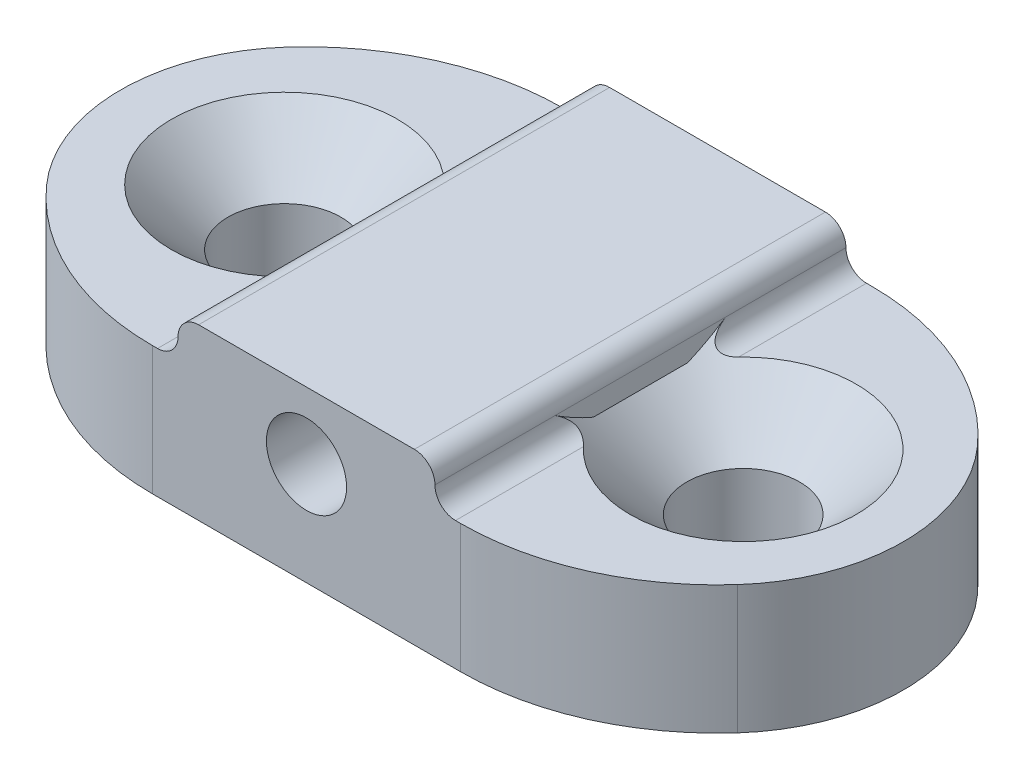
ISO-10303-21;
HEADER;
FILE_DESCRIPTION(('STEP AP214'),'2;1');
FILE_NAME('part.step','',(''),(''),'','','');
FILE_SCHEMA(('AUTOMOTIVE_DESIGN { 1 0 10303 214 1 1 1 1 }'));
ENDSEC;
DATA;
#1=APPLICATION_CONTEXT('core data for automotive mechanical design processes');
#2=APPLICATION_PROTOCOL_DEFINITION('international standard','automotive_design',2000,#1);
#3=PRODUCT_CONTEXT('',#1,'mechanical');
#4=PRODUCT('Part','Part','',(#3));
#5=PRODUCT_RELATED_PRODUCT_CATEGORY('part','',(#4));
#6=PRODUCT_DEFINITION_FORMATION('','',#4);
#7=PRODUCT_DEFINITION_CONTEXT('part definition',#1,'design');
#8=PRODUCT_DEFINITION('design','',#6,#7);
#9=PRODUCT_DEFINITION_SHAPE('','',#8);
#10=(LENGTH_UNIT() NAMED_UNIT(*) SI_UNIT(.MILLI.,.METRE.));
#11=(NAMED_UNIT(*) PLANE_ANGLE_UNIT() SI_UNIT($,.RADIAN.));
#12=(NAMED_UNIT(*) SI_UNIT($,.STERADIAN.) SOLID_ANGLE_UNIT());
#13=UNCERTAINTY_MEASURE_WITH_UNIT(LENGTH_MEASURE(1.E-05),#10,'distance_accuracy_value','');
#14=(GEOMETRIC_REPRESENTATION_CONTEXT(3) GLOBAL_UNCERTAINTY_ASSIGNED_CONTEXT((#13)) GLOBAL_UNIT_ASSIGNED_CONTEXT((#10,
#11,#12)) REPRESENTATION_CONTEXT('',''));
#15=CARTESIAN_POINT('',(0.,0.,0.));
#16=DIRECTION('',(0.,0.,1.));
#17=DIRECTION('',(1.,0.,0.));
#18=AXIS2_PLACEMENT_3D('',#15,#16,#17);
#19=CARTESIAN_POINT('',(0.,2.5,0.));
#20=DIRECTION('',(0.,-1.,0.));
#21=DIRECTION('',(0.,0.,-1.));
#22=AXIS2_PLACEMENT_3D('',#19,#20,#21);
#23=PLANE('',#22);
#24=CARTESIAN_POINT('',(5.,2.5,-3.));
#25=DIRECTION('',(0.,-1.,0.));
#26=DIRECTION('',(0.,0.,-1.));
#27=AXIS2_PLACEMENT_3D('',#24,#25,#26);
#28=CIRCLE('',#27,5.);
#29=CARTESIAN_POINT('',(5.,2.5,-8.));
#30=VERTEX_POINT('',#29);
#31=CARTESIAN_POINT('',(1.27322003750035,2.5,-6.33333333333333));
#32=VERTEX_POINT('',#31);
#33=EDGE_CURVE('E363',#30,#32,#28,.F.);
#34=ORIENTED_EDGE('',*,*,#33,.T.);
#35=CARTESIAN_POINT('',(3.88196601125011,2.5,-4.));
#36=DIRECTION('',(0.,-1.,0.));
#37=DIRECTION('',(0.,0.,-1.));
#38=AXIS2_PLACEMENT_3D('',#35,#36,#37);
#39=CIRCLE('',#38,3.5);
#40=CARTESIAN_POINT('',(1.27322003750035,2.5,-1.66666666666667));
#41=VERTEX_POINT('',#40);
#42=EDGE_CURVE('E368',#32,#41,#39,.F.);
#43=ORIENTED_EDGE('',*,*,#42,.T.);
#44=CARTESIAN_POINT('',(5.,2.5,-5.));
#45=DIRECTION('',(0.,-1.,0.));
#46=DIRECTION('',(0.,0.,-1.));
#47=AXIS2_PLACEMENT_3D('',#44,#45,#46);
#48=CIRCLE('',#47,5.);
#49=CARTESIAN_POINT('',(5.,2.5,0.));
#50=VERTEX_POINT('',#49);
#51=EDGE_CURVE('E361',#41,#50,#48,.F.);
#52=ORIENTED_EDGE('',*,*,#51,.T.);
#53=DIRECTION('',(1.,0.,0.));
#54=VECTOR('',#53,1.);
#55=CARTESIAN_POINT('',(0.,2.5,0.));
#56=LINE('',#55,#54);
#57=CARTESIAN_POINT('',(5.1,2.5,0.));
#58=VERTEX_POINT('',#57);
#59=EDGE_CURVE('E200',#50,#58,#56,.T.);
#60=ORIENTED_EDGE('',*,*,#59,.T.);
#61=DIRECTION('',(0.,0.,1.));
#62=VECTOR('',#61,1.);
#63=CARTESIAN_POINT('',(5.1,2.5,0.));
#64=LINE('',#63,#62);
#65=CARTESIAN_POINT('',(5.1,2.5,-2.41808901716345));
#66=VERTEX_POINT('',#65);
#67=EDGE_CURVE('E251',#58,#66,#64,.F.);
#68=ORIENTED_EDGE('',*,*,#67,.T.);
#69=CARTESIAN_POINT('',(3.57109266389977,2.5,-4.));
#70=DIRECTION('',(0.,1.,0.));
#71=DIRECTION('',(0.,0.,1.));
#72=AXIS2_PLACEMENT_3D('',#69,#70,#71);
#73=CIRCLE('',#72,2.2);
#74=CARTESIAN_POINT('',(5.1,2.5,-5.58191098283655));
#75=VERTEX_POINT('',#74);
#76=EDGE_CURVE('E415',#75,#66,#73,.T.);
#77=ORIENTED_EDGE('',*,*,#76,.F.);
#78=DIRECTION('',(0.,0.,1.));
#79=VECTOR('',#78,1.);
#80=CARTESIAN_POINT('',(5.1,2.5,0.));
#81=LINE('',#80,#79);
#82=CARTESIAN_POINT('',(5.1,2.5,-8.));
#83=VERTEX_POINT('',#82);
#84=EDGE_CURVE('E481',#75,#83,#81,.F.);
#85=ORIENTED_EDGE('',*,*,#84,.T.);
#86=DIRECTION('',(-1.,0.,0.));
#87=VECTOR('',#86,1.);
#88=CARTESIAN_POINT('',(0.,2.5,-8.));
#89=LINE('',#88,#87);
#90=EDGE_CURVE('E202',#83,#30,#89,.T.);
#91=ORIENTED_EDGE('',*,*,#90,.T.);
#92=EDGE_LOOP('',(#34,#43,#52,#60,#68,#77,#85,#91));
#93=FACE_BOUND('',#92,.T.);
#94=ADVANCED_FACE('F34',(#93),#23,.F.);
#95=CARTESIAN_POINT('',(0.,2.5,0.));
#96=DIRECTION('',(0.,0.,-1.));
#97=DIRECTION('',(-1.,0.,0.));
#98=AXIS2_PLACEMENT_3D('',#95,#96,#97);
#99=PLANE('',#98);
#100=CARTESIAN_POINT('',(8.,2.,0.));
#101=DIRECTION('',(0.,0.,-1.));
#102=DIRECTION('',(-1.,0.,0.));
#103=AXIS2_PLACEMENT_3D('',#100,#101,#102);
#104=CIRCLE('',#103,0.779999999999999);
#105=CARTESIAN_POINT('',(7.22,2.,0.));
#106=VERTEX_POINT('',#105);
#107=EDGE_CURVE('E444',#106,#106,#104,.T.);
#108=ORIENTED_EDGE('',*,*,#107,.T.);
#109=EDGE_LOOP('',(#108));
#110=FACE_BOUND('',#109,.T.);
#111=DIRECTION('',(1.,0.,0.));
#112=VECTOR('',#111,1.);
#113=CARTESIAN_POINT('',(0.,0.,0.));
#114=LINE('',#113,#112);
#115=CARTESIAN_POINT('',(5.,0.,0.));
#116=VERTEX_POINT('',#115);
#117=CARTESIAN_POINT('',(11.,0.,0.));
#118=VERTEX_POINT('',#117);
#119=EDGE_CURVE('E193',#116,#118,#114,.T.);
#120=ORIENTED_EDGE('',*,*,#119,.T.);
#121=DIRECTION('',(0.,-1.,0.));
#122=VECTOR('',#121,1.);
#123=CARTESIAN_POINT('',(11.,2.5,0.));
#124=LINE('',#123,#122);
#125=CARTESIAN_POINT('',(11.,2.5,0.));
#126=VERTEX_POINT('',#125);
#127=EDGE_CURVE('E356',#118,#126,#124,.F.);
#128=ORIENTED_EDGE('',*,*,#127,.T.);
#129=CARTESIAN_POINT('',(10.9,2.5,0.));
#130=VERTEX_POINT('',#129);
#131=EDGE_CURVE('E203',#130,#126,#56,.T.);
#132=ORIENTED_EDGE('',*,*,#131,.F.);
#133=CARTESIAN_POINT('',(10.9,2.9,0.));
#134=DIRECTION('',(0.,0.,-1.));
#135=DIRECTION('',(-1.,0.,0.));
#136=AXIS2_PLACEMENT_3D('',#133,#134,#135);
#137=CIRCLE('',#136,0.4);
#138=CARTESIAN_POINT('',(10.5,2.9,0.));
#139=VERTEX_POINT('',#138);
#140=EDGE_CURVE('E281',#130,#139,#137,.T.);
#141=ORIENTED_EDGE('',*,*,#140,.T.);
#142=CARTESIAN_POINT('',(10.1,2.9,0.));
#143=DIRECTION('',(0.,0.,-1.));
#144=DIRECTION('',(-1.,0.,0.));
#145=AXIS2_PLACEMENT_3D('',#142,#143,#144);
#146=CIRCLE('',#145,0.4);
#147=CARTESIAN_POINT('',(10.1,3.3,0.));
#148=VERTEX_POINT('',#147);
#149=EDGE_CURVE('E426',#139,#148,#146,.F.);
#150=ORIENTED_EDGE('',*,*,#149,.T.);
#151=DIRECTION('',(-1.,0.,0.));
#152=VECTOR('',#151,1.);
#153=CARTESIAN_POINT('',(5.5,3.3,0.));
#154=LINE('',#153,#152);
#155=CARTESIAN_POINT('',(5.9,3.3,0.));
#156=VERTEX_POINT('',#155);
#157=EDGE_CURVE('E196',#148,#156,#154,.T.);
#158=ORIENTED_EDGE('',*,*,#157,.T.);
#159=CARTESIAN_POINT('',(5.9,2.9,0.));
#160=DIRECTION('',(0.,0.,-1.));
#161=DIRECTION('',(-1.,0.,0.));
#162=AXIS2_PLACEMENT_3D('',#159,#160,#161);
#163=CIRCLE('',#162,0.4);
#164=CARTESIAN_POINT('',(5.5,2.9,0.));
#165=VERTEX_POINT('',#164);
#166=EDGE_CURVE('E449',#156,#165,#163,.F.);
#167=ORIENTED_EDGE('',*,*,#166,.T.);
#168=CARTESIAN_POINT('',(5.1,2.9,0.));
#169=DIRECTION('',(0.,0.,-1.));
#170=DIRECTION('',(-1.,0.,0.));
#171=AXIS2_PLACEMENT_3D('',#168,#169,#170);
#172=CIRCLE('',#171,0.4);
#173=EDGE_CURVE('E280',#165,#58,#172,.T.);
#174=ORIENTED_EDGE('',*,*,#173,.T.);
#175=ORIENTED_EDGE('',*,*,#59,.F.);
#176=DIRECTION('',(0.,-1.,0.));
#177=VECTOR('',#176,1.);
#178=CARTESIAN_POINT('',(5.,2.5,0.));
#179=LINE('',#178,#177);
#180=EDGE_CURVE('E390',#50,#116,#179,.T.);
#181=ORIENTED_EDGE('',*,*,#180,.T.);
#182=EDGE_LOOP('',(#120,#128,#132,#141,#150,#158,#167,#174,#175,#181));
#183=FACE_BOUND('',#182,.T.);
#184=ADVANCED_FACE('F262',(#110,#183),#99,.F.);
#185=CARTESIAN_POINT('',(0.,2.5,-8.));
#186=DIRECTION('',(0.,0.,1.));
#187=DIRECTION('',(1.,0.,0.));
#188=AXIS2_PLACEMENT_3D('',#185,#186,#187);
#189=PLANE('',#188);
#190=CARTESIAN_POINT('',(8.,2.,-8.));
#191=DIRECTION('',(0.,0.,1.));
#192=DIRECTION('',(1.,0.,0.));
#193=AXIS2_PLACEMENT_3D('',#190,#191,#192);
#194=CIRCLE('',#193,0.779999999999999);
#195=CARTESIAN_POINT('',(8.78,2.,-8.));
#196=VERTEX_POINT('',#195);
#197=EDGE_CURVE('E441',#196,#196,#194,.T.);
#198=ORIENTED_EDGE('',*,*,#197,.T.);
#199=EDGE_LOOP('',(#198));
#200=FACE_BOUND('',#199,.T.);
#201=CARTESIAN_POINT('',(11.,2.5,-8.));
#202=VERTEX_POINT('',#201);
#203=CARTESIAN_POINT('',(10.9,2.5,-8.));
#204=VERTEX_POINT('',#203);
#205=EDGE_CURVE('E204',#202,#204,#89,.T.);
#206=ORIENTED_EDGE('',*,*,#205,.F.);
#207=DIRECTION('',(0.,-1.,0.));
#208=VECTOR('',#207,1.);
#209=CARTESIAN_POINT('',(11.,2.5,-8.));
#210=LINE('',#209,#208);
#211=CARTESIAN_POINT('',(11.,0.,-8.));
#212=VERTEX_POINT('',#211);
#213=EDGE_CURVE('E354',#202,#212,#210,.T.);
#214=ORIENTED_EDGE('',*,*,#213,.T.);
#215=DIRECTION('',(-1.,0.,0.));
#216=VECTOR('',#215,1.);
#217=CARTESIAN_POINT('',(0.,0.,-8.));
#218=LINE('',#217,#216);
#219=CARTESIAN_POINT('',(5.,0.,-8.));
#220=VERTEX_POINT('',#219);
#221=EDGE_CURVE('E209',#212,#220,#218,.T.);
#222=ORIENTED_EDGE('',*,*,#221,.T.);
#223=DIRECTION('',(0.,-1.,0.));
#224=VECTOR('',#223,1.);
#225=CARTESIAN_POINT('',(5.,2.5,-8.));
#226=LINE('',#225,#224);
#227=EDGE_CURVE('E350',#220,#30,#226,.F.);
#228=ORIENTED_EDGE('',*,*,#227,.T.);
#229=ORIENTED_EDGE('',*,*,#90,.F.);
#230=CARTESIAN_POINT('',(5.1,2.9,-8.));
#231=DIRECTION('',(0.,0.,1.));
#232=DIRECTION('',(1.,0.,0.));
#233=AXIS2_PLACEMENT_3D('',#230,#231,#232);
#234=CIRCLE('',#233,0.4);
#235=CARTESIAN_POINT('',(5.5,2.9,-8.));
#236=VERTEX_POINT('',#235);
#237=EDGE_CURVE('E403',#83,#236,#234,.T.);
#238=ORIENTED_EDGE('',*,*,#237,.T.);
#239=CARTESIAN_POINT('',(5.9,2.9,-8.));
#240=DIRECTION('',(0.,0.,1.));
#241=DIRECTION('',(1.,0.,0.));
#242=AXIS2_PLACEMENT_3D('',#239,#240,#241);
#243=CIRCLE('',#242,0.4);
#244=CARTESIAN_POINT('',(5.9,3.3,-8.));
#245=VERTEX_POINT('',#244);
#246=EDGE_CURVE('E458',#236,#245,#243,.F.);
#247=ORIENTED_EDGE('',*,*,#246,.T.);
#248=DIRECTION('',(1.,0.,0.));
#249=VECTOR('',#248,1.);
#250=CARTESIAN_POINT('',(5.5,3.3,-8.));
#251=LINE('',#250,#249);
#252=CARTESIAN_POINT('',(10.1,3.3,-8.));
#253=VERTEX_POINT('',#252);
#254=EDGE_CURVE('E189',#245,#253,#251,.T.);
#255=ORIENTED_EDGE('',*,*,#254,.T.);
#256=CARTESIAN_POINT('',(10.1,2.9,-8.));
#257=DIRECTION('',(0.,0.,1.));
#258=DIRECTION('',(1.,0.,0.));
#259=AXIS2_PLACEMENT_3D('',#256,#257,#258);
#260=CIRCLE('',#259,0.4);
#261=CARTESIAN_POINT('',(10.5,2.9,-8.));
#262=VERTEX_POINT('',#261);
#263=EDGE_CURVE('E423',#253,#262,#260,.F.);
#264=ORIENTED_EDGE('',*,*,#263,.T.);
#265=CARTESIAN_POINT('',(10.9,2.9,-8.));
#266=DIRECTION('',(0.,0.,1.));
#267=DIRECTION('',(1.,0.,0.));
#268=AXIS2_PLACEMENT_3D('',#265,#266,#267);
#269=CIRCLE('',#268,0.4);
#270=EDGE_CURVE('E250',#262,#204,#269,.T.);
#271=ORIENTED_EDGE('',*,*,#270,.T.);
#272=EDGE_LOOP('',(#206,#214,#222,#228,#229,#238,#247,#255,#264,#271));
#273=FACE_BOUND('',#272,.T.);
#274=ADVANCED_FACE('F332',(#200,#273),#189,.F.);
#275=CARTESIAN_POINT('',(11.,2.5,-5.));
#276=DIRECTION('',(0.,-1.,0.));
#277=DIRECTION('',(0.,0.,-1.));
#278=AXIS2_PLACEMENT_3D('',#275,#276,#277);
#279=CIRCLE('',#278,5.);
#280=CARTESIAN_POINT('',(14.7267799624996,2.5,-1.66666666666667));
#281=VERTEX_POINT('',#280);
#282=EDGE_CURVE('E346',#126,#281,#279,.F.);
#283=ORIENTED_EDGE('',*,*,#282,.T.);
#284=CARTESIAN_POINT('',(12.1180339887499,2.5,-4.));
#285=DIRECTION('',(0.,-1.,0.));
#286=DIRECTION('',(0.,0.,-1.));
#287=AXIS2_PLACEMENT_3D('',#284,#285,#286);
#288=CIRCLE('',#287,3.5);
#289=CARTESIAN_POINT('',(14.7267799624996,2.5,-6.33333333333333));
#290=VERTEX_POINT('',#289);
#291=EDGE_CURVE('E42',#281,#290,#288,.F.);
#292=ORIENTED_EDGE('',*,*,#291,.T.);
#293=CARTESIAN_POINT('',(11.,2.5,-3.));
#294=DIRECTION('',(0.,-1.,0.));
#295=DIRECTION('',(0.,0.,-1.));
#296=AXIS2_PLACEMENT_3D('',#293,#294,#295);
#297=CIRCLE('',#296,5.);
#298=EDGE_CURVE('E351',#290,#202,#297,.F.);
#299=ORIENTED_EDGE('',*,*,#298,.T.);
#300=ORIENTED_EDGE('',*,*,#205,.T.);
#301=DIRECTION('',(0.,0.,1.));
#302=VECTOR('',#301,1.);
#303=CARTESIAN_POINT('',(10.9,2.5,0.));
#304=LINE('',#303,#302);
#305=CARTESIAN_POINT('',(10.9,2.5,-5.50996688705415));
#306=VERTEX_POINT('',#305);
#307=EDGE_CURVE('E213',#204,#306,#304,.T.);
#308=ORIENTED_EDGE('',*,*,#307,.T.);
#309=CARTESIAN_POINT('',(12.5,2.5,-4.));
#310=DIRECTION('',(0.,1.,0.));
#311=DIRECTION('',(0.,0.,1.));
#312=AXIS2_PLACEMENT_3D('',#309,#310,#311);
#313=CIRCLE('',#312,2.2);
#314=CARTESIAN_POINT('',(10.9,2.5,-2.49003311294585));
#315=VERTEX_POINT('',#314);
#316=EDGE_CURVE('E186',#315,#306,#313,.T.);
#317=ORIENTED_EDGE('',*,*,#316,.F.);
#318=DIRECTION('',(0.,0.,1.));
#319=VECTOR('',#318,1.);
#320=CARTESIAN_POINT('',(10.9,2.5,0.));
#321=LINE('',#320,#319);
#322=EDGE_CURVE('E206',#315,#130,#321,.T.);
#323=ORIENTED_EDGE('',*,*,#322,.T.);
#324=ORIENTED_EDGE('',*,*,#131,.T.);
#325=EDGE_LOOP('',(#283,#292,#299,#300,#308,#317,#323,#324));
#326=FACE_BOUND('',#325,.T.);
#327=ADVANCED_FACE('F328',(#326),#23,.F.);
#328=CARTESIAN_POINT('',(0.,0.,0.));
#329=DIRECTION('',(0.,-1.,0.));
#330=DIRECTION('',(0.,0.,-1.));
#331=AXIS2_PLACEMENT_3D('',#328,#329,#330);
#332=PLANE('',#331);
#333=CARTESIAN_POINT('',(3.57109266389977,0.,-4.));
#334=DIRECTION('',(0.,1.,0.));
#335=DIRECTION('',(0.,0.,1.));
#336=AXIS2_PLACEMENT_3D('',#333,#334,#335);
#337=CIRCLE('',#336,1.1);
#338=CARTESIAN_POINT('',(3.57109266389977,0.,-2.9));
#339=VERTEX_POINT('',#338);
#340=EDGE_CURVE('E430',#339,#339,#337,.T.);
#341=ORIENTED_EDGE('',*,*,#340,.T.);
#342=EDGE_LOOP('',(#341));
#343=FACE_BOUND('',#342,.T.);
#344=CARTESIAN_POINT('',(12.5,0.,-4.));
#345=DIRECTION('',(0.,1.,0.));
#346=DIRECTION('',(0.,0.,1.));
#347=AXIS2_PLACEMENT_3D('',#344,#345,#346);
#348=CIRCLE('',#347,1.1);
#349=CARTESIAN_POINT('',(12.5,0.,-2.9));
#350=VERTEX_POINT('',#349);
#351=EDGE_CURVE('E438',#350,#350,#348,.T.);
#352=ORIENTED_EDGE('',*,*,#351,.T.);
#353=EDGE_LOOP('',(#352));
#354=FACE_BOUND('',#353,.T.);
#355=CARTESIAN_POINT('',(5.,0.,-5.));
#356=DIRECTION('',(0.,-1.,0.));
#357=DIRECTION('',(0.,0.,-1.));
#358=AXIS2_PLACEMENT_3D('',#355,#356,#357);
#359=CIRCLE('',#358,5.);
#360=CARTESIAN_POINT('',(1.27322003750035,0.,-1.66666666666667));
#361=VERTEX_POINT('',#360);
#362=EDGE_CURVE('E392',#116,#361,#359,.T.);
#363=ORIENTED_EDGE('',*,*,#362,.T.);
#364=CARTESIAN_POINT('',(3.88196601125011,0.,-4.));
#365=DIRECTION('',(0.,-1.,0.));
#366=DIRECTION('',(0.,0.,-1.));
#367=AXIS2_PLACEMENT_3D('',#364,#365,#366);
#368=CIRCLE('',#367,3.5);
#369=CARTESIAN_POINT('',(1.27322003750035,0.,-6.33333333333333));
#370=VERTEX_POINT('',#369);
#371=EDGE_CURVE('E374',#361,#370,#368,.T.);
#372=ORIENTED_EDGE('',*,*,#371,.T.);
#373=CARTESIAN_POINT('',(5.,0.,-3.));
#374=DIRECTION('',(0.,-1.,0.));
#375=DIRECTION('',(0.,0.,-1.));
#376=AXIS2_PLACEMENT_3D('',#373,#374,#375);
#377=CIRCLE('',#376,5.);
#378=EDGE_CURVE('E388',#370,#220,#377,.T.);
#379=ORIENTED_EDGE('',*,*,#378,.T.);
#380=ORIENTED_EDGE('',*,*,#221,.F.);
#381=CARTESIAN_POINT('',(11.,0.,-3.));
#382=DIRECTION('',(0.,-1.,0.));
#383=DIRECTION('',(0.,0.,-1.));
#384=AXIS2_PLACEMENT_3D('',#381,#382,#383);
#385=CIRCLE('',#384,5.);
#386=CARTESIAN_POINT('',(14.7267799624996,0.,-6.33333333333333));
#387=VERTEX_POINT('',#386);
#388=EDGE_CURVE('E386',#212,#387,#385,.T.);
#389=ORIENTED_EDGE('',*,*,#388,.T.);
#390=CARTESIAN_POINT('',(12.1180339887499,0.,-4.));
#391=DIRECTION('',(0.,-1.,0.));
#392=DIRECTION('',(0.,0.,-1.));
#393=AXIS2_PLACEMENT_3D('',#390,#391,#392);
#394=CIRCLE('',#393,3.5);
#395=CARTESIAN_POINT('',(14.7267799624996,0.,-1.66666666666667));
#396=VERTEX_POINT('',#395);
#397=EDGE_CURVE('E372',#387,#396,#394,.T.);
#398=ORIENTED_EDGE('',*,*,#397,.T.);
#399=CARTESIAN_POINT('',(11.,0.,-5.));
#400=DIRECTION('',(0.,-1.,0.));
#401=DIRECTION('',(0.,0.,-1.));
#402=AXIS2_PLACEMENT_3D('',#399,#400,#401);
#403=CIRCLE('',#402,5.);
#404=EDGE_CURVE('E378',#396,#118,#403,.T.);
#405=ORIENTED_EDGE('',*,*,#404,.T.);
#406=ORIENTED_EDGE('',*,*,#119,.F.);
#407=EDGE_LOOP('',(#363,#372,#379,#380,#389,#398,#405,#406));
#408=FACE_BOUND('',#407,.T.);
#409=ADVANCED_FACE('F337',(#343,#354,#408),#332,.T.);
#410=CARTESIAN_POINT('',(5.5,2.5,-13.0635955604689));
#411=DIRECTION('',(-1.,0.,0.));
#412=DIRECTION('',(0.,-1.,0.));
#413=AXIS2_PLACEMENT_3D('',#410,#411,#412);
#414=PLANE('',#413);
#415=DIRECTION('',(0.,0.,1.));
#416=VECTOR('',#415,1.);
#417=CARTESIAN_POINT('',(5.5,2.5,-13.0635955604689));
#418=LINE('',#417,#416);
#419=CARTESIAN_POINT('',(5.5,2.5,-5.05797754642463));
#420=VERTEX_POINT('',#419);
#421=CARTESIAN_POINT('',(5.5,2.5,-2.94202245357536));
#422=VERTEX_POINT('',#421);
#423=EDGE_CURVE('E190',#420,#422,#418,.T.);
#424=ORIENTED_EDGE('',*,*,#423,.T.);
#425=CARTESIAN_POINT('',(5.5,2.5,-2.94202245357536));
#426=CARTESIAN_POINT('',(5.5,2.52872917775644,-2.8823228496387));
#427=CARTESIAN_POINT('',(5.5,2.55893294478922,-2.82335937948788));
#428=CARTESIAN_POINT('',(5.5,2.62175738827018,-2.70682487240755));
#429=CARTESIAN_POINT('',(5.5,2.6543750152887,-2.64925219651247));
#430=CARTESIAN_POINT('',(5.5,2.72155791669848,-2.53529023365637));
#431=CARTESIAN_POINT('',(5.5,2.75612255971361,-2.47890057111754));
#432=CARTESIAN_POINT('',(5.5,2.82691084229986,-2.36707219379437));
#433=CARTESIAN_POINT('',(5.5,2.86313648702678,-2.31163474568505));
#434=CARTESIAN_POINT('',(5.5,2.90000000000016,-2.25663644389946));
#435=B_SPLINE_CURVE_WITH_KNOTS('',3,(#425,#426,#427,#428,#429,#430,#431,#432,#433,#434),
.UNSPECIFIED.,.F.,.F.,(4,2,2,2,4),(0.,0.198703135537779,0.397159399098888,0.595551673880541,
0.794190099681815),.UNSPECIFIED.);
#436=CARTESIAN_POINT('',(5.5,2.9,-2.25663644389938));
#437=VERTEX_POINT('',#436);
#438=EDGE_CURVE('E476',#422,#437,#435,.T.);
#439=ORIENTED_EDGE('',*,*,#438,.T.);
#440=DIRECTION('',(0.,0.,1.));
#441=VECTOR('',#440,1.);
#442=CARTESIAN_POINT('',(5.5,2.9,-13.0635955604689));
#443=LINE('',#442,#441);
#444=CARTESIAN_POINT('',(5.5,2.9,-5.74336355610062));
#445=VERTEX_POINT('',#444);
#446=EDGE_CURVE('E470',#437,#445,#443,.F.);
#447=ORIENTED_EDGE('',*,*,#446,.T.);
#448=CARTESIAN_POINT('',(5.5,2.9,-5.74336355610062));
#449=CARTESIAN_POINT('',(5.5,2.86313648702672,-5.68836525431496));
#450=CARTESIAN_POINT('',(5.5,2.82691084229984,-5.63292780620562));
#451=CARTESIAN_POINT('',(5.5,2.75612255971362,-5.52109942888244));
#452=CARTESIAN_POINT('',(5.5,2.72155791669848,-5.46470976634362));
#453=CARTESIAN_POINT('',(5.5,2.65437501528869,-5.35074780348753));
#454=CARTESIAN_POINT('',(5.5,2.62175738827018,-5.29317512759244));
#455=CARTESIAN_POINT('',(5.5,2.55893294478922,-5.17664062051212));
#456=CARTESIAN_POINT('',(5.5,2.52872917775644,-5.11767715036129));
#457=CARTESIAN_POINT('',(5.5,2.5,-5.05797754642463));
#458=B_SPLINE_CURVE_WITH_KNOTS('',3,(#448,#449,#450,#451,#452,#453,#454,#455,#456,#457),
.UNSPECIFIED.,.F.,.F.,(4,2,2,2,4),(0.,0.198638425801267,0.397030700582914,0.595486964144023,
0.794190099681799),.UNSPECIFIED.);
#459=EDGE_CURVE('E465',#445,#420,#458,.T.);
#460=ORIENTED_EDGE('',*,*,#459,.T.);
#461=EDGE_LOOP('',(#424,#439,#447,#460));
#462=FACE_BOUND('',#461,.T.);
#463=ADVANCED_FACE('F342',(#462),#414,.T.);
#464=CARTESIAN_POINT('',(5.5,3.3,-13.0635955604689));
#465=DIRECTION('',(0.,1.,0.));
#466=DIRECTION('',(-1.,0.,0.));
#467=AXIS2_PLACEMENT_3D('',#464,#465,#466);
#468=PLANE('',#467);
#469=ORIENTED_EDGE('',*,*,#157,.F.);
#470=DIRECTION('',(0.,0.,1.));
#471=VECTOR('',#470,1.);
#472=CARTESIAN_POINT('',(10.1,3.3,-13.0635955604689));
#473=LINE('',#472,#471);
#474=EDGE_CURVE('E455',#148,#253,#473,.F.);
#475=ORIENTED_EDGE('',*,*,#474,.T.);
#476=ORIENTED_EDGE('',*,*,#254,.F.);
#477=DIRECTION('',(0.,0.,1.));
#478=VECTOR('',#477,1.);
#479=CARTESIAN_POINT('',(5.9,3.3,-13.0635955604689));
#480=LINE('',#479,#478);
#481=EDGE_CURVE('E457',#245,#156,#480,.T.);
#482=ORIENTED_EDGE('',*,*,#481,.T.);
#483=EDGE_LOOP('',(#469,#475,#476,#482));
#484=FACE_BOUND('',#483,.T.);
#485=ADVANCED_FACE('F453',(#484),#468,.T.);
#486=CARTESIAN_POINT('',(10.5,2.5,-13.0635955604689));
#487=DIRECTION('',(1.,0.,0.));
#488=DIRECTION('',(0.,1.,0.));
#489=AXIS2_PLACEMENT_3D('',#486,#487,#488);
#490=PLANE('',#489);
#491=DIRECTION('',(0.,0.,1.));
#492=VECTOR('',#491,1.);
#493=CARTESIAN_POINT('',(10.5,2.5,-13.0635955604689));
#494=LINE('',#493,#492);
#495=CARTESIAN_POINT('',(10.5,2.5,-4.91651513899117));
#496=VERTEX_POINT('',#495);
#497=CARTESIAN_POINT('',(10.5,2.5,-3.08348486100883));
#498=VERTEX_POINT('',#497);
#499=EDGE_CURVE('E174',#496,#498,#494,.T.);
#500=ORIENTED_EDGE('',*,*,#499,.F.);
#501=CARTESIAN_POINT('',(10.5,2.5,-4.91651513899117));
#502=CARTESIAN_POINT('',(10.5,2.52718727449056,-4.98172105472955));
#503=CARTESIAN_POINT('',(10.5,2.55636217171402,-5.04605522553401));
#504=CARTESIAN_POINT('',(10.5,2.61794446605888,-5.17301690717014));
#505=CARTESIAN_POINT('',(10.5,2.65034577979058,-5.23564735663984));
#506=CARTESIAN_POINT('',(10.5,2.71772744515605,-5.35944845668019));
#507=CARTESIAN_POINT('',(10.5,2.75270653042835,-5.42061980475769));
#508=CARTESIAN_POINT('',(10.5,2.82484715782165,-5.54181848776246));
#509=CARTESIAN_POINT('',(10.5,2.86201261655119,-5.60184349772124));
#510=CARTESIAN_POINT('',(10.5,2.9,-5.66132477258362));
#511=B_SPLINE_CURVE_WITH_KNOTS('',3,(#501,#502,#503,#504,#505,#506,#507,#508,#509,#510),
.UNSPECIFIED.,.F.,.F.,(4,2,2,2,4),(0.,0.211850082373242,0.423308025594079,0.634662771281031,
0.846408397578629),.UNSPECIFIED.);
#512=CARTESIAN_POINT('',(10.5,2.9,-5.66132477258362));
#513=VERTEX_POINT('',#512);
#514=EDGE_CURVE('E180',#496,#513,#511,.T.);
#515=ORIENTED_EDGE('',*,*,#514,.T.);
#516=DIRECTION('',(0.,0.,1.));
#517=VECTOR('',#516,1.);
#518=CARTESIAN_POINT('',(10.5,2.9,-13.0635955604689));
#519=LINE('',#518,#517);
#520=CARTESIAN_POINT('',(10.5,2.9,-2.33867522741638));
#521=VERTEX_POINT('',#520);
#522=EDGE_CURVE('E177',#513,#521,#519,.T.);
#523=ORIENTED_EDGE('',*,*,#522,.T.);
#524=CARTESIAN_POINT('',(10.5,2.9,-2.33867522741638));
#525=CARTESIAN_POINT('',(10.5,2.86201261655119,-2.39815650227876));
#526=CARTESIAN_POINT('',(10.5,2.82484715782165,-2.45818151223754));
#527=CARTESIAN_POINT('',(10.5,2.75270653042835,-2.57938019524231));
#528=CARTESIAN_POINT('',(10.5,2.71772744515605,-2.64055154331982));
#529=CARTESIAN_POINT('',(10.5,2.65034577979058,-2.76435264336016));
#530=CARTESIAN_POINT('',(10.5,2.61794446605888,-2.82698309282986));
#531=CARTESIAN_POINT('',(10.5,2.55636217171402,-2.95394477446599));
#532=CARTESIAN_POINT('',(10.5,2.52718727449056,-3.01827894527045));
#533=CARTESIAN_POINT('',(10.5,2.5,-3.08348486100883));
#534=B_SPLINE_CURVE_WITH_KNOTS('',3,(#524,#525,#526,#527,#528,#529,#530,#531,#532,#533),
.UNSPECIFIED.,.F.,.F.,(4,2,2,2,4),(0.,0.2117456262976,0.423100371984554,0.634558315205392,
0.846408397578635),.UNSPECIFIED.);
#535=EDGE_CURVE('E169',#521,#498,#534,.T.);
#536=ORIENTED_EDGE('',*,*,#535,.T.);
#537=EDGE_LOOP('',(#500,#515,#523,#536));
#538=FACE_BOUND('',#537,.T.);
#539=ADVANCED_FACE('F171',(#538),#490,.T.);
#540=CARTESIAN_POINT('',(8.,2.,-8.));
#541=DIRECTION('',(0.,0.,1.));
#542=DIRECTION('',(1.,0.,0.));
#543=AXIS2_PLACEMENT_3D('',#540,#541,#542);
#544=CYLINDRICAL_SURFACE('',#543,0.779999999999999);
#545=ORIENTED_EDGE('',*,*,#197,.F.);
#546=EDGE_LOOP('',(#545));
#547=FACE_BOUND('',#546,.T.);
#548=ORIENTED_EDGE('',*,*,#107,.F.);
#549=EDGE_LOOP('',(#548));
#550=FACE_BOUND('',#549,.T.);
#551=ADVANCED_FACE('F619',(#547,#550),#544,.F.);
#552=CARTESIAN_POINT('',(14.7,2.5,-4.));
#553=DIRECTION('',(0.,1.,0.));
#554=DIRECTION('',(0.,0.,1.));
#555=AXIS2_PLACEMENT_3D('',#552,#553,#554);
#556=PLANE('',#555);
#557=ORIENTED_EDGE('',*,*,#499,.T.);
#558=EDGE_CURVE('E182',#496,#498,#313,.T.);
#559=ORIENTED_EDGE('',*,*,#558,.F.);
#560=EDGE_LOOP('',(#557,#559));
#561=FACE_BOUND('',#560,.T.);
#562=ADVANCED_FACE('F188',(#561),#556,.F.);
#563=CARTESIAN_POINT('',(12.5,2.5,-4.));
#564=DIRECTION('',(0.,1.,0.));
#565=DIRECTION('',(0.,0.,1.));
#566=AXIS2_PLACEMENT_3D('',#563,#564,#565);
#567=CYLINDRICAL_SURFACE('',#566,1.1);
#568=ORIENTED_EDGE('',*,*,#351,.F.);
#569=EDGE_LOOP('',(#568));
#570=FACE_BOUND('',#569,.T.);
#571=CARTESIAN_POINT('',(12.5,1.4,-4.));
#572=DIRECTION('',(0.,1.,0.));
#573=DIRECTION('',(0.,0.,1.));
#574=AXIS2_PLACEMENT_3D('',#571,#572,#573);
#575=CIRCLE('',#574,1.1);
#576=CARTESIAN_POINT('',(12.5,1.4,-2.9));
#577=VERTEX_POINT('',#576);
#578=EDGE_CURVE('E185',#577,#577,#575,.T.);
#579=ORIENTED_EDGE('',*,*,#578,.T.);
#580=EDGE_LOOP('',(#579));
#581=FACE_BOUND('',#580,.T.);
#582=ADVANCED_FACE('F234',(#570,#581),#567,.F.);
#583=CARTESIAN_POINT('',(12.5,2.5,-4.));
#584=DIRECTION('',(0.,1.,0.));
#585=DIRECTION('',(0.,0.,1.));
#586=AXIS2_PLACEMENT_3D('',#583,#584,#585);
#587=CONICAL_SURFACE('',#586,2.2,0.785398163397448);
#588=ORIENTED_EDGE('',*,*,#578,.F.);
#589=EDGE_LOOP('',(#588));
#590=FACE_BOUND('',#589,.T.);
#591=ORIENTED_EDGE('',*,*,#558,.T.);
#592=ORIENTED_EDGE('',*,*,#535,.F.);
#593=CARTESIAN_POINT('',(10.5,2.9,-2.33867522741638));
#594=CARTESIAN_POINT('',(10.5000082115001,2.88928184889667,-2.35543698650999));
#595=CARTESIAN_POINT('',(10.5004313809724,2.87840196629674,-2.37210715317471));
#596=CARTESIAN_POINT('',(10.5022445597365,2.85621944205861,-2.40520183485894));
#597=CARTESIAN_POINT('',(10.5036382940098,2.84491533092787,-2.42162515356213));
#598=CARTESIAN_POINT('',(10.5075543072099,2.82173213370308,-2.45422182633193));
#599=CARTESIAN_POINT('',(10.5100895929725,2.80984786962051,-2.47039001129778));
#600=CARTESIAN_POINT('',(10.51651299931,2.78556364454504,-2.5020285714298));
#601=CARTESIAN_POINT('',(10.5203987895313,2.77316460406494,-2.51750009709939));
#602=CARTESIAN_POINT('',(10.5286496397397,2.75100210123375,-2.54355370103504));
#603=CARTESIAN_POINT('',(10.5326361853925,2.74137826352862,-2.55437210633327));
#604=CARTESIAN_POINT('',(10.5417500176447,2.72174695607069,-2.57516743955946));
#605=CARTESIAN_POINT('',(10.5468773942677,2.7117394560945,-2.58514430099501));
#606=CARTESIAN_POINT('',(10.558605701714,2.69121356762826,-2.60396690067397));
#607=CARTESIAN_POINT('',(10.5652248310792,2.6806902459439,-2.61279634271062));
#608=CARTESIAN_POINT('',(10.5801917406879,2.65939612437952,-2.62847108877861));
#609=CARTESIAN_POINT('',(10.5885330179989,2.6486263872187,-2.63532363084752));
#610=CARTESIAN_POINT('',(10.6039128580293,2.63089174530198,-2.64430467375412));
#611=CARTESIAN_POINT('',(10.6104226849201,2.62388415559201,-2.64724728385563));
#612=CARTESIAN_POINT('',(10.6241861626942,2.6101362992266,-2.65164645237734));
#613=CARTESIAN_POINT('',(10.631439107581,2.60339578712653,-2.65310440714174));
#614=CARTESIAN_POINT('',(10.6465319866877,2.59039812427842,-2.65441656338549));
#615=CARTESIAN_POINT('',(10.6543732135156,2.58414210318983,-2.65426712405161));
#616=CARTESIAN_POINT('',(10.6703845377211,2.57231706245705,-2.65242365793966));
#617=CARTESIAN_POINT('',(10.6785549020436,2.5667486159744,-2.65072835226743));
#618=CARTESIAN_POINT('',(10.6972460533728,2.55497250694134,-2.64535849488883));
#619=CARTESIAN_POINT('',(10.707798170129,2.54900694770339,-2.64126925884805));
#620=CARTESIAN_POINT('',(10.728770642434,2.53830954920871,-2.63146699880835));
#621=CARTESIAN_POINT('',(10.7391906308501,2.53358063671031,-2.62575018839405));
#622=CARTESIAN_POINT('',(10.7662465349036,2.52258988500056,-2.60919376397902));
#623=CARTESIAN_POINT('',(10.7826588204232,2.51724174862954,-2.59739698155804));
#624=CARTESIAN_POINT('',(10.8146774305171,2.50885424647161,-2.57201912184637));
#625=CARTESIAN_POINT('',(10.8302809080553,2.50582258000457,-2.55843226873657));
#626=CARTESIAN_POINT('',(10.8548997267719,2.50243789828712,-2.53557481421081));
#627=CARTESIAN_POINT('',(10.8641550906149,2.50150404996848,-2.52663773825739));
#628=CARTESIAN_POINT('',(10.8823144621081,2.50028889474641,-2.50851475190431));
#629=CARTESIAN_POINT('',(10.8912207125452,2.50000235071077,-2.49933145134352));
#630=CARTESIAN_POINT('',(10.9000000000022,2.4999999999963,-2.4900331129488));
#631=B_SPLINE_CURVE_WITH_KNOTS('',3,(#593,#594,#595,#596,#597,#598,#599,#600,#601,#602,#603,
#604,#605,#606,#607,#608,#609,#610,#611,#612,#613,#614,#615,#616,#617,#618,#619,#620,#621,#622,
#623,#624,#625,#626,#627,#628,#629,#630),.UNSPECIFIED.,.F.,.F.,(4,2,2,2,2,2,2,2,2,2,2,2,2,2,2,2,
2,2,4),(0.,0.0596969180766508,0.119624221948447,0.180252328134844,0.240776333102282,
0.285777723638769,0.330782666519025,0.376369614131377,0.421787471830135,0.451686511017577,
0.481557403592904,0.511495969180004,0.541459325415419,0.579622595075581,0.617875384227349,
0.680249383347249,0.742829805667947,0.78150775100625,0.819871627262304),.UNSPECIFIED.);
#632=EDGE_CURVE('E275',#521,#315,#631,.T.);
#633=ORIENTED_EDGE('',*,*,#632,.T.);
#634=ORIENTED_EDGE('',*,*,#316,.T.);
#635=CARTESIAN_POINT('',(10.9,2.5,-5.50996688705415));
#636=CARTESIAN_POINT('',(10.89095148795,2.50000278412556,-5.5003824739581));
#637=CARTESIAN_POINT('',(10.8817755963747,2.50030660862329,-5.49092934625797));
#638=CARTESIAN_POINT('',(10.8630999130022,2.50159484214976,-5.47232915485972));
#639=CARTESIAN_POINT('',(10.8535990654736,2.50258172002601,-5.46318332802342));
#640=CARTESIAN_POINT('',(10.8242887363401,2.50672734012162,-5.43608411646345));
#641=CARTESIAN_POINT('',(10.8039659307153,2.51107649227757,-5.41878895375473));
#642=CARTESIAN_POINT('',(10.7726866125124,2.52065052885067,-5.39564826732727));
#643=CARTESIAN_POINT('',(10.7622389187228,2.52429773124547,-5.38846171783246));
#644=CARTESIAN_POINT('',(10.7410766118703,2.53274982918775,-5.37531661793096));
#645=CARTESIAN_POINT('',(10.7303631657617,2.53755026668816,-5.36935349881667));
#646=CARTESIAN_POINT('',(10.7104842940797,2.54759787445383,-5.35993023281932));
#647=CARTESIAN_POINT('',(10.7013419683236,2.5526543700821,-5.35622340013142));
#648=CARTESIAN_POINT('',(10.6831307328907,2.56372507370143,-5.35036959346878));
#649=CARTESIAN_POINT('',(10.6740617561525,2.56973826955585,-5.34822098418426));
#650=CARTESIAN_POINT('',(10.6562050048475,2.58268880949329,-5.34578166531657));
#651=CARTESIAN_POINT('',(10.647420373576,2.58963375793891,-5.34550732699135));
#652=CARTESIAN_POINT('',(10.6305632793084,2.60414933909905,-5.34697061605468));
#653=CARTESIAN_POINT('',(10.6224909141937,2.61172005753246,-5.3487085195086));
#654=CARTESIAN_POINT('',(10.6083107897731,2.62612764168212,-5.35365630510975));
#655=CARTESIAN_POINT('',(10.6020844477334,2.63292877796882,-5.35664056082613));
#656=CARTESIAN_POINT('',(10.5903916684481,2.64657652404887,-5.36375127601687));
#657=CARTESIAN_POINT('',(10.5849254233283,2.65342314488256,-5.36787802348754));
#658=CARTESIAN_POINT('',(10.57105906742,2.6719382669796,-5.38031879447169));
#659=CARTESIAN_POINT('',(10.5633675664334,2.68354219051667,-5.38951285400012));
#660=CARTESIAN_POINT('',(10.5497640418162,2.70632147287976,-5.40960272355589));
#661=CARTESIAN_POINT('',(10.5438589850982,2.7174950091924,-5.42050495074448));
#662=CARTESIAN_POINT('',(10.5285457018978,2.74972788854458,-5.4541923302043));
#663=CARTESIAN_POINT('',(10.5211059185057,2.77014289234727,-5.47846453245346));
#664=CARTESIAN_POINT('',(10.5098205743706,2.80957111026032,-5.52886103478543));
#665=CARTESIAN_POINT('',(10.505984837035,2.82858036376107,-5.55499018925042));
#666=CARTESIAN_POINT('',(10.5023065370367,2.85614409950149,-5.59473671398908));
#667=CARTESIAN_POINT('',(10.5014254087938,2.86511297140259,-5.60798129228236));
#668=CARTESIAN_POINT('',(10.5002749762774,2.88275517540316,-5.63457119722973));
#669=CARTESIAN_POINT('',(10.5000018127919,2.89143002545175,-5.64791534574849));
#670=CARTESIAN_POINT('',(10.4999999999999,2.89999999999975,-5.66132477258378));
#671=B_SPLINE_CURVE_WITH_KNOTS('',3,(#635,#636,#637,#638,#639,#640,#641,#642,#643,#644,#645,
#646,#647,#648,#649,#650,#651,#652,#653,#654,#655,#656,#657,#658,#659,#660,#661,#662,#663,#664,
#665,#666,#667,#668,#669,#670),.UNSPECIFIED.,.F.,.F.,(4,2,2,2,2,2,2,2,2,2,2,2,2,2,2,2,2,4),(0.,
0.0395185015250118,0.0791805908923919,0.159801891436203,0.199308695045002,0.238665167922435,
0.271798254220734,0.304896517797985,0.338283520397399,0.371675104000363,0.400640951860443,
0.429614108014082,0.479373150729277,0.529323817648211,0.626514212822978,0.723968754074214,
0.772015281860424,0.819755941512631),.UNSPECIFIED.);
#672=EDGE_CURVE('E243',#306,#513,#671,.T.);
#673=ORIENTED_EDGE('',*,*,#672,.T.);
#674=ORIENTED_EDGE('',*,*,#514,.F.);
#675=EDGE_LOOP('',(#591,#592,#633,#634,#673,#674));
#676=FACE_BOUND('',#675,.T.);
#677=ADVANCED_FACE('F183',(#590,#676),#587,.F.);
#678=CARTESIAN_POINT('',(5.77109266389977,2.5,-4.));
#679=DIRECTION('',(0.,1.,0.));
#680=DIRECTION('',(0.,0.,1.));
#681=AXIS2_PLACEMENT_3D('',#678,#679,#680);
#682=PLANE('',#681);
#683=EDGE_CURVE('E492',#422,#420,#73,.T.);
#684=ORIENTED_EDGE('',*,*,#683,.F.);
#685=ORIENTED_EDGE('',*,*,#423,.F.);
#686=EDGE_LOOP('',(#684,#685));
#687=FACE_BOUND('',#686,.T.);
#688=ADVANCED_FACE('F233',(#687),#682,.F.);
#689=CARTESIAN_POINT('',(3.57109266389977,2.5,-4.));
#690=DIRECTION('',(0.,1.,0.));
#691=DIRECTION('',(0.,0.,1.));
#692=AXIS2_PLACEMENT_3D('',#689,#690,#691);
#693=CYLINDRICAL_SURFACE('',#692,1.1);
#694=ORIENTED_EDGE('',*,*,#340,.F.);
#695=EDGE_LOOP('',(#694));
#696=FACE_BOUND('',#695,.T.);
#697=CARTESIAN_POINT('',(3.57109266389977,1.4,-4.));
#698=DIRECTION('',(0.,1.,0.));
#699=DIRECTION('',(0.,0.,1.));
#700=AXIS2_PLACEMENT_3D('',#697,#698,#699);
#701=CIRCLE('',#700,1.1);
#702=CARTESIAN_POINT('',(3.57109266389977,1.4,-2.9));
#703=VERTEX_POINT('',#702);
#704=EDGE_CURVE('E432',#703,#703,#701,.T.);
#705=ORIENTED_EDGE('',*,*,#704,.T.);
#706=EDGE_LOOP('',(#705));
#707=FACE_BOUND('',#706,.T.);
#708=ADVANCED_FACE('F583',(#696,#707),#693,.F.);
#709=CARTESIAN_POINT('',(3.57109266389977,2.5,-4.));
#710=DIRECTION('',(0.,1.,0.));
#711=DIRECTION('',(0.,0.,1.));
#712=AXIS2_PLACEMENT_3D('',#709,#710,#711);
#713=CONICAL_SURFACE('',#712,2.2,0.785398163397448);
#714=ORIENTED_EDGE('',*,*,#704,.F.);
#715=EDGE_LOOP('',(#714));
#716=FACE_BOUND('',#715,.T.);
#717=ORIENTED_EDGE('',*,*,#683,.T.);
#718=ORIENTED_EDGE('',*,*,#459,.F.);
#719=CARTESIAN_POINT('',(5.5,2.9,-5.74336355610062));
#720=CARTESIAN_POINT('',(5.49999136763082,2.88892369684227,-5.72685653939563));
#721=CARTESIAN_POINT('',(5.49953929041826,2.87767595938755,-5.71045096726849));
#722=CARTESIAN_POINT('',(5.49760065747495,2.85473763389681,-5.67791060651088));
#723=CARTESIAN_POINT('',(5.4961096432398,2.84304534332893,-5.66177729302956));
#724=CARTESIAN_POINT('',(5.49191431487362,2.81904794940522,-5.62977458499987));
#725=CARTESIAN_POINT('',(5.48919351089556,2.80673660843164,-5.61391192327921));
#726=CARTESIAN_POINT('',(5.4822990169416,2.7816049914364,-5.58295502524112));
#727=CARTESIAN_POINT('',(5.47812813328771,2.76878574052082,-5.56785936875936));
#728=CARTESIAN_POINT('',(5.46923127657779,2.74579158070104,-5.54240174889348));
#729=CARTESIAN_POINT('',(5.46489596415807,2.73574432954036,-5.53179059012286));
#730=CARTESIAN_POINT('',(5.45498868895684,2.71530569382548,-5.51150928611));
#731=CARTESIAN_POINT('',(5.4494173628034,2.70491448876586,-5.50183866010684));
#732=CARTESIAN_POINT('',(5.43669570211774,2.68368680494989,-5.48374460890664));
#733=CARTESIAN_POINT('',(5.42952511077936,2.67284621392814,-5.4753397364947));
#734=CARTESIAN_POINT('',(5.41339260865433,2.65106890020263,-5.46063604104729));
#735=CARTESIAN_POINT('',(5.40443700821382,2.64013264236294,-5.45433000218358));
#736=CARTESIAN_POINT('',(5.38776546943453,2.62198553483326,-5.44613924064814));
#737=CARTESIAN_POINT('',(5.38053442191228,2.61467685951503,-5.4434889345194));
#738=CARTESIAN_POINT('',(5.36530509728891,2.60046485007593,-5.43977474958797));
#739=CARTESIAN_POINT('',(5.35730735644765,2.59356123800578,-5.43870977043001));
#740=CARTESIAN_POINT('',(5.34075354069501,2.58039136539911,-5.43823154861351));
#741=CARTESIAN_POINT('',(5.33219723062171,2.57412537618458,-5.43881900608144));
#742=CARTESIAN_POINT('',(5.31478580039523,2.56239427703476,-5.44152882454392));
#743=CARTESIAN_POINT('',(5.30593043553671,2.55692984352401,-5.44365247305277));
#744=CARTESIAN_POINT('',(5.2851411752602,2.54516266383084,-5.45013860868419));
#745=CARTESIAN_POINT('',(5.27317731648408,2.53919977347245,-5.45501490675438));
#746=CARTESIAN_POINT('',(5.24943214509841,2.52873251078828,-5.46648326709478));
#747=CARTESIAN_POINT('',(5.23765142605589,2.52423220101591,-5.47308001823973));
#748=CARTESIAN_POINT('',(5.20717133572129,2.51411124228026,-5.49197358183871));
#749=CARTESIAN_POINT('',(5.18874297697942,2.50954446249764,-5.50525825074156));
#750=CARTESIAN_POINT('',(5.15289622524546,2.503093906716,-5.53363501654749));
#751=CARTESIAN_POINT('',(5.13547881597328,2.50121270331981,-5.54872883151258));
#752=CARTESIAN_POINT('',(5.11229728844507,2.50014139672036,-5.57015414234851));
#753=CARTESIAN_POINT('',(5.10611666919671,2.50000217616796,-5.57600310781624));
#754=CARTESIAN_POINT('',(5.1,2.5,-5.58191098283654));
#755=B_SPLINE_CURVE_WITH_KNOTS('',3,(#719,#720,#721,#722,#723,#724,#725,#726,#727,#728,#729,
#730,#731,#732,#733,#734,#735,#736,#737,#738,#739,#740,#741,#742,#743,#744,#745,#746,#747,#748,
#749,#750,#751,#752,#753,#754),.UNSPECIFIED.,.F.,.F.,(4,2,2,2,2,2,2,2,2,2,2,2,2,2,2,2,2,4),(0.,
0.0596477017575986,0.119552965485268,0.180286468266079,0.240903082535902,0.286568445804732,
0.332210342801464,0.378466985993911,0.424562914442398,0.456278064201081,0.487971190597048,
0.519677747183257,0.551410908542076,0.593857943597616,0.636421893985566,0.705551885189715,
0.774748053974386,0.800269433356907),.UNSPECIFIED.);
#756=EDGE_CURVE('E291',#445,#75,#755,.T.);
#757=ORIENTED_EDGE('',*,*,#756,.T.);
#758=ORIENTED_EDGE('',*,*,#76,.T.);
#759=CARTESIAN_POINT('',(5.1,2.5,-2.41808901716345));
#760=CARTESIAN_POINT('',(5.11692133041905,2.50003894899364,-2.43436046984483));
#761=CARTESIAN_POINT('',(5.13437719861686,2.50107989764037,-2.45033373557224));
#762=CARTESIAN_POINT('',(5.17064177926314,2.50584289317805,-2.48087968445439));
#763=CARTESIAN_POINT('',(5.18946911124822,2.50961258606489,-2.49542218823794));
#764=CARTESIAN_POINT('',(5.2202393500693,2.5183171724471,-2.51627811294098));
#765=CARTESIAN_POINT('',(5.23184753051378,2.52214440139781,-2.52352411295638));
#766=CARTESIAN_POINT('',(5.25530501204877,2.53116729652256,-2.53654741340937));
#767=CARTESIAN_POINT('',(5.26715293592996,2.53635649660564,-2.54233140668581));
#768=CARTESIAN_POINT('',(5.28855252073546,2.54706784244601,-2.55095587005838));
#769=CARTESIAN_POINT('',(5.2980931082356,2.55231938584599,-2.55415273972654));
#770=CARTESIAN_POINT('',(5.31699789762438,2.56379505532083,-2.55894307079807));
#771=CARTESIAN_POINT('',(5.32636223187244,2.57001841604404,-2.56053778668756));
#772=CARTESIAN_POINT('',(5.34467185542493,2.58335426407295,-2.56188872103206));
#773=CARTESIAN_POINT('',(5.35361432975182,2.59047180620146,-2.56163397850841));
#774=CARTESIAN_POINT('',(5.37071131352408,2.60530752215562,-2.55922406483087));
#775=CARTESIAN_POINT('',(5.37886550969666,2.61302593259283,-2.55706814153826));
#776=CARTESIAN_POINT('',(5.39352885789877,2.62807738384482,-2.55131943728797));
#777=CARTESIAN_POINT('',(5.40011916236,2.6353865312037,-2.54786607510296));
#778=CARTESIAN_POINT('',(5.41244871236122,2.65006454119901,-2.53979058814684));
#779=CARTESIAN_POINT('',(5.41818775852928,2.65743341739958,-2.53516819026119));
#780=CARTESIAN_POINT('',(5.43288616908157,2.67764712181402,-2.52117189759783));
#781=CARTESIAN_POINT('',(5.4410122216884,2.6904328502528,-2.51084274737851));
#782=CARTESIAN_POINT('',(5.45523538705334,2.71556300021158,-2.48838860090407));
#783=CARTESIAN_POINT('',(5.46132419361738,2.7279054362388,-2.47625653711308));
#784=CARTESIAN_POINT('',(5.4767556022259,2.76324073630332,-2.43918047948757));
#785=CARTESIAN_POINT('',(5.48392988001396,2.78557283722739,-2.41272796474606));
#786=CARTESIAN_POINT('',(5.49421529035315,2.82871211006536,-2.35795854285852));
#787=CARTESIAN_POINT('',(5.49732038421048,2.84951697245789,-2.32963893018853));
#788=CARTESIAN_POINT('',(5.49924086329429,2.8748451527017,-2.29351240304075));
#789=CARTESIAN_POINT('',(5.49952836428084,2.87993744920735,-2.28616158744766));
#790=CARTESIAN_POINT('',(5.49990776758189,2.89003135748862,-2.27142738195627));
#791=CARTESIAN_POINT('',(5.50000029161479,2.89503320693427,-2.26404417105339));
#792=CARTESIAN_POINT('',(5.5,2.90000000000014,-2.25663644389948));
#793=B_SPLINE_CURVE_WITH_KNOTS('',3,(#759,#760,#761,#762,#763,#764,#765,#766,#767,#768,#769,
#770,#771,#772,#773,#774,#775,#776,#777,#778,#779,#780,#781,#782,#783,#784,#785,#786,#787,#788,
#789,#790,#791,#792),.UNSPECIFIED.,.F.,.F.,(4,2,2,2,2,2,2,2,2,2,2,2,2,2,2,2,4),(0.,
0.070691567089925,0.142648188834003,0.185166093778205,0.227485681695048,0.261404009442586,
0.295295758398953,0.329388533066221,0.363494801455959,0.394669745838585,0.425851980168138,
0.480538112537686,0.535444567148869,0.640921897518409,0.746555580296745,0.773395019448609,
0.800148746004989),.UNSPECIFIED.);
#794=EDGE_CURVE('E284',#66,#437,#793,.T.);
#795=ORIENTED_EDGE('',*,*,#794,.T.);
#796=ORIENTED_EDGE('',*,*,#438,.F.);
#797=EDGE_LOOP('',(#717,#718,#757,#758,#795,#796));
#798=FACE_BOUND('',#797,.T.);
#799=ADVANCED_FACE('F271',(#716,#798),#713,.F.);
#800=CARTESIAN_POINT('',(10.9,2.9,0.));
#801=DIRECTION('',(0.,0.,1.));
#802=DIRECTION('',(1.,0.,0.));
#803=AXIS2_PLACEMENT_3D('',#800,#801,#802);
#804=CYLINDRICAL_SURFACE('',#803,0.4);
#805=ORIENTED_EDGE('',*,*,#322,.F.);
#806=ORIENTED_EDGE('',*,*,#632,.F.);
#807=DIRECTION('',(0.,0.,1.));
#808=VECTOR('',#807,1.);
#809=CARTESIAN_POINT('',(10.5,2.9,-13.0635955604689));
#810=LINE('',#809,#808);
#811=EDGE_CURVE('E412',#139,#521,#810,.F.);
#812=ORIENTED_EDGE('',*,*,#811,.F.);
#813=ORIENTED_EDGE('',*,*,#140,.F.);
#814=EDGE_LOOP('',(#805,#806,#812,#813));
#815=FACE_BOUND('',#814,.T.);
#816=ADVANCED_FACE('F266',(#815),#804,.F.);
#817=CARTESIAN_POINT('',(10.1,2.9,-13.0635955604689));
#818=DIRECTION('',(0.,0.,1.));
#819=DIRECTION('',(1.,0.,0.));
#820=AXIS2_PLACEMENT_3D('',#817,#818,#819);
#821=CYLINDRICAL_SURFACE('',#820,0.4);
#822=DIRECTION('',(0.,0.,1.));
#823=VECTOR('',#822,1.);
#824=CARTESIAN_POINT('',(10.5,2.9,-13.0635955604689));
#825=LINE('',#824,#823);
#826=EDGE_CURVE('E408',#262,#513,#825,.T.);
#827=ORIENTED_EDGE('',*,*,#826,.F.);
#828=ORIENTED_EDGE('',*,*,#263,.F.);
#829=ORIENTED_EDGE('',*,*,#474,.F.);
#830=ORIENTED_EDGE('',*,*,#149,.F.);
#831=ORIENTED_EDGE('',*,*,#811,.T.);
#832=ORIENTED_EDGE('',*,*,#522,.F.);
#833=EDGE_LOOP('',(#827,#828,#829,#830,#831,#832));
#834=FACE_BOUND('',#833,.T.);
#835=ADVANCED_FACE('F260',(#834),#821,.T.);
#836=CARTESIAN_POINT('',(10.9,2.9,0.));
#837=DIRECTION('',(0.,0.,1.));
#838=DIRECTION('',(1.,0.,0.));
#839=AXIS2_PLACEMENT_3D('',#836,#837,#838);
#840=CYLINDRICAL_SURFACE('',#839,0.4);
#841=ORIENTED_EDGE('',*,*,#270,.F.);
#842=ORIENTED_EDGE('',*,*,#826,.T.);
#843=ORIENTED_EDGE('',*,*,#672,.F.);
#844=ORIENTED_EDGE('',*,*,#307,.F.);
#845=EDGE_LOOP('',(#841,#842,#843,#844));
#846=FACE_BOUND('',#845,.T.);
#847=ADVANCED_FACE('F254',(#846),#840,.F.);
#848=CARTESIAN_POINT('',(5.1,2.9,-13.0635955604689));
#849=DIRECTION('',(0.,0.,1.));
#850=DIRECTION('',(1.,0.,0.));
#851=AXIS2_PLACEMENT_3D('',#848,#849,#850);
#852=CYLINDRICAL_SURFACE('',#851,0.4);
#853=ORIENTED_EDGE('',*,*,#67,.F.);
#854=ORIENTED_EDGE('',*,*,#173,.F.);
#855=DIRECTION('',(0.,0.,1.));
#856=VECTOR('',#855,1.);
#857=CARTESIAN_POINT('',(5.5,2.9,-13.0635955604689));
#858=LINE('',#857,#856);
#859=EDGE_CURVE('E405',#437,#165,#858,.T.);
#860=ORIENTED_EDGE('',*,*,#859,.F.);
#861=ORIENTED_EDGE('',*,*,#794,.F.);
#862=EDGE_LOOP('',(#853,#854,#860,#861));
#863=FACE_BOUND('',#862,.T.);
#864=ADVANCED_FACE('F259',(#863),#852,.F.);
#865=CARTESIAN_POINT('',(5.1,2.9,-13.0635955604689));
#866=DIRECTION('',(0.,0.,1.));
#867=DIRECTION('',(1.,0.,0.));
#868=AXIS2_PLACEMENT_3D('',#865,#866,#867);
#869=CYLINDRICAL_SURFACE('',#868,0.4);
#870=ORIENTED_EDGE('',*,*,#84,.F.);
#871=ORIENTED_EDGE('',*,*,#756,.F.);
#872=DIRECTION('',(0.,0.,1.));
#873=VECTOR('',#872,1.);
#874=CARTESIAN_POINT('',(5.5,2.9,-13.0635955604689));
#875=LINE('',#874,#873);
#876=EDGE_CURVE('E409',#236,#445,#875,.T.);
#877=ORIENTED_EDGE('',*,*,#876,.F.);
#878=ORIENTED_EDGE('',*,*,#237,.F.);
#879=EDGE_LOOP('',(#870,#871,#877,#878));
#880=FACE_BOUND('',#879,.T.);
#881=ADVANCED_FACE('F300',(#880),#869,.F.);
#882=CARTESIAN_POINT('',(5.9,2.9,-13.0635955604689));
#883=DIRECTION('',(0.,0.,1.));
#884=DIRECTION('',(1.,0.,0.));
#885=AXIS2_PLACEMENT_3D('',#882,#883,#884);
#886=CYLINDRICAL_SURFACE('',#885,0.4);
#887=ORIENTED_EDGE('',*,*,#446,.F.);
#888=ORIENTED_EDGE('',*,*,#859,.T.);
#889=ORIENTED_EDGE('',*,*,#166,.F.);
#890=ORIENTED_EDGE('',*,*,#481,.F.);
#891=ORIENTED_EDGE('',*,*,#246,.F.);
#892=ORIENTED_EDGE('',*,*,#876,.T.);
#893=EDGE_LOOP('',(#887,#888,#889,#890,#891,#892));
#894=FACE_BOUND('',#893,.T.);
#895=ADVANCED_FACE('F273',(#894),#886,.T.);
#896=CARTESIAN_POINT('',(11.,2.5,-3.));
#897=DIRECTION('',(0.,-1.,0.));
#898=DIRECTION('',(0.,0.,-1.));
#899=AXIS2_PLACEMENT_3D('',#896,#897,#898);
#900=CYLINDRICAL_SURFACE('',#899,5.);
#901=ORIENTED_EDGE('',*,*,#298,.F.);
#902=DIRECTION('',(0.,-1.,0.));
#903=VECTOR('',#902,1.);
#904=CARTESIAN_POINT('',(14.7267799624997,2.5,-6.33333333333333));
#905=LINE('',#904,#903);
#906=EDGE_CURVE('E11',#290,#387,#905,.T.);
#907=ORIENTED_EDGE('',*,*,#906,.T.);
#908=ORIENTED_EDGE('',*,*,#388,.F.);
#909=ORIENTED_EDGE('',*,*,#213,.F.);
#910=EDGE_LOOP('',(#901,#907,#908,#909));
#911=FACE_BOUND('',#910,.T.);
#912=ADVANCED_FACE('F307',(#911),#900,.T.);
#913=CARTESIAN_POINT('',(11.,2.5,-5.));
#914=DIRECTION('',(0.,-1.,0.));
#915=DIRECTION('',(0.,0.,-1.));
#916=AXIS2_PLACEMENT_3D('',#913,#914,#915);
#917=CYLINDRICAL_SURFACE('',#916,5.);
#918=ORIENTED_EDGE('',*,*,#404,.F.);
#919=DIRECTION('',(0.,-1.,0.));
#920=VECTOR('',#919,1.);
#921=CARTESIAN_POINT('',(14.7267799624997,2.5,-1.66666666666667));
#922=LINE('',#921,#920);
#923=EDGE_CURVE('E376',#396,#281,#922,.F.);
#924=ORIENTED_EDGE('',*,*,#923,.T.);
#925=ORIENTED_EDGE('',*,*,#282,.F.);
#926=ORIENTED_EDGE('',*,*,#127,.F.);
#927=EDGE_LOOP('',(#918,#924,#925,#926));
#928=FACE_BOUND('',#927,.T.);
#929=ADVANCED_FACE('F303',(#928),#917,.T.);
#930=CARTESIAN_POINT('',(5.,2.5,-5.));
#931=DIRECTION('',(0.,-1.,0.));
#932=DIRECTION('',(0.,0.,-1.));
#933=AXIS2_PLACEMENT_3D('',#930,#931,#932);
#934=CYLINDRICAL_SURFACE('',#933,5.);
#935=ORIENTED_EDGE('',*,*,#51,.F.);
#936=DIRECTION('',(0.,-1.,0.));
#937=VECTOR('',#936,1.);
#938=CARTESIAN_POINT('',(1.27322003750035,2.5,-1.66666666666667));
#939=LINE('',#938,#937);
#940=EDGE_CURVE('E370',#41,#361,#939,.T.);
#941=ORIENTED_EDGE('',*,*,#940,.T.);
#942=ORIENTED_EDGE('',*,*,#362,.F.);
#943=ORIENTED_EDGE('',*,*,#180,.F.);
#944=EDGE_LOOP('',(#935,#941,#942,#943));
#945=FACE_BOUND('',#944,.T.);
#946=ADVANCED_FACE('F306',(#945),#934,.T.);
#947=CARTESIAN_POINT('',(5.,2.5,-3.));
#948=DIRECTION('',(0.,-1.,0.));
#949=DIRECTION('',(0.,0.,-1.));
#950=AXIS2_PLACEMENT_3D('',#947,#948,#949);
#951=CYLINDRICAL_SURFACE('',#950,5.);
#952=ORIENTED_EDGE('',*,*,#378,.F.);
#953=DIRECTION('',(0.,-1.,0.));
#954=VECTOR('',#953,1.);
#955=CARTESIAN_POINT('',(1.27322003750035,2.5,-6.33333333333333));
#956=LINE('',#955,#954);
#957=EDGE_CURVE('E365',#370,#32,#956,.F.);
#958=ORIENTED_EDGE('',*,*,#957,.T.);
#959=ORIENTED_EDGE('',*,*,#33,.F.);
#960=ORIENTED_EDGE('',*,*,#227,.F.);
#961=EDGE_LOOP('',(#952,#958,#959,#960));
#962=FACE_BOUND('',#961,.T.);
#963=ADVANCED_FACE('F312',(#962),#951,.T.);
#964=CARTESIAN_POINT('',(3.88196601125011,2.5,-4.));
#965=DIRECTION('',(0.,1.,0.));
#966=DIRECTION('',(0.,0.,1.));
#967=AXIS2_PLACEMENT_3D('',#964,#965,#966);
#968=CYLINDRICAL_SURFACE('',#967,3.5);
#969=ORIENTED_EDGE('',*,*,#371,.F.);
#970=ORIENTED_EDGE('',*,*,#940,.F.);
#971=ORIENTED_EDGE('',*,*,#42,.F.);
#972=ORIENTED_EDGE('',*,*,#957,.F.);
#973=EDGE_LOOP('',(#969,#970,#971,#972));
#974=FACE_BOUND('',#973,.T.);
#975=ADVANCED_FACE('F315',(#974),#968,.T.);
#976=CARTESIAN_POINT('',(12.1180339887499,2.5,-4.));
#977=DIRECTION('',(0.,1.,0.));
#978=DIRECTION('',(0.,0.,1.));
#979=AXIS2_PLACEMENT_3D('',#976,#977,#978);
#980=CYLINDRICAL_SURFACE('',#979,3.5);
#981=ORIENTED_EDGE('',*,*,#397,.F.);
#982=ORIENTED_EDGE('',*,*,#906,.F.);
#983=ORIENTED_EDGE('',*,*,#291,.F.);
#984=ORIENTED_EDGE('',*,*,#923,.F.);
#985=EDGE_LOOP('',(#981,#982,#983,#984));
#986=FACE_BOUND('',#985,.T.);
#987=ADVANCED_FACE('F36',(#986),#980,.T.);
#988=CLOSED_SHELL('',(#94,#184,#274,#327,#409,#463,#485,#539,#551,#562,#582,#677,#688,#708,#799,
#816,#835,#847,#864,#881,#895,#912,#929,#946,#963,#975,#987));
#989=MANIFOLD_SOLID_BREP('B2',#988);
#990=ADVANCED_BREP_SHAPE_REPRESENTATION('',(#18,#989),#14);
#991=SHAPE_DEFINITION_REPRESENTATION(#9,#990);
ENDSEC;
END-ISO-10303-21;
